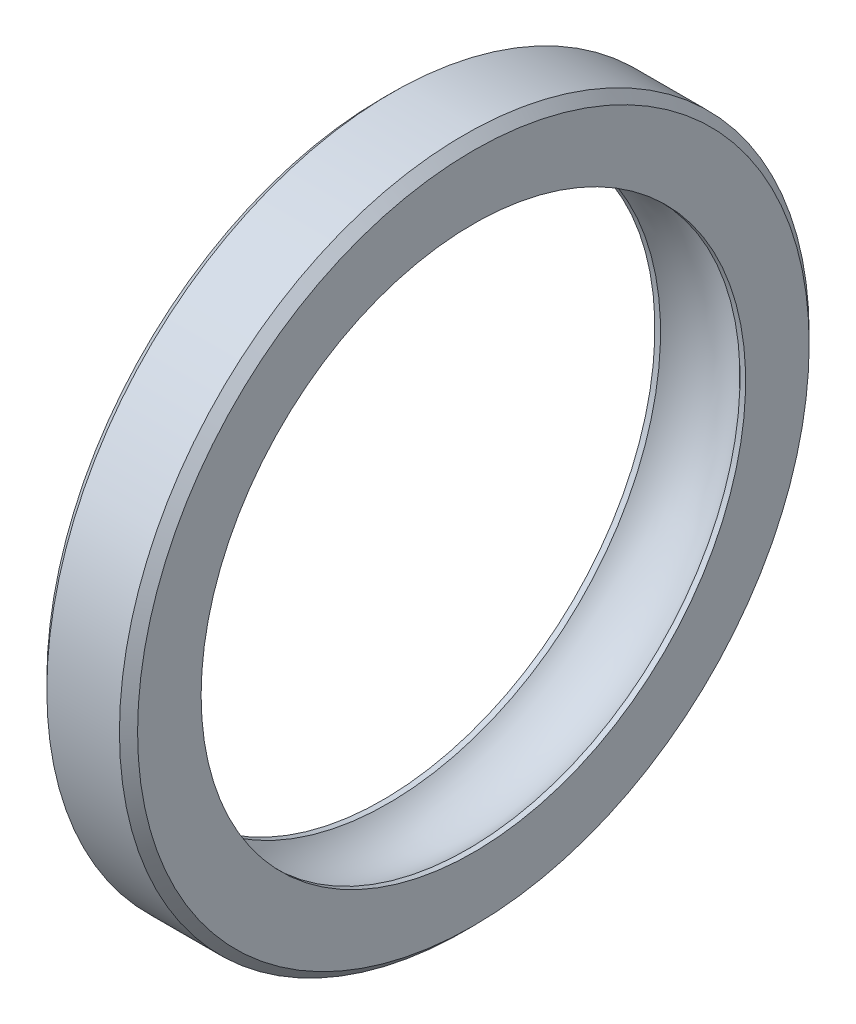
ISO-10303-21;
HEADER;
FILE_DESCRIPTION(('STEP AP214'),'2;1');
FILE_NAME('part.step','',(''),(''),'','','');
FILE_SCHEMA(('AUTOMOTIVE_DESIGN { 1 0 10303 214 1 1 1 1 }'));
ENDSEC;
DATA;
#1=APPLICATION_CONTEXT('core data for automotive mechanical design processes');
#2=APPLICATION_PROTOCOL_DEFINITION('international standard','automotive_design',2000,#1);
#3=PRODUCT_CONTEXT('',#1,'mechanical');
#4=PRODUCT('Part','Part','',(#3));
#5=PRODUCT_RELATED_PRODUCT_CATEGORY('part','',(#4));
#6=PRODUCT_DEFINITION_FORMATION('','',#4);
#7=PRODUCT_DEFINITION_CONTEXT('part definition',#1,'design');
#8=PRODUCT_DEFINITION('design','',#6,#7);
#9=PRODUCT_DEFINITION_SHAPE('','',#8);
#10=(LENGTH_UNIT() NAMED_UNIT(*) SI_UNIT(.MILLI.,.METRE.));
#11=(NAMED_UNIT(*) PLANE_ANGLE_UNIT() SI_UNIT($,.RADIAN.));
#12=(NAMED_UNIT(*) SI_UNIT($,.STERADIAN.) SOLID_ANGLE_UNIT());
#13=UNCERTAINTY_MEASURE_WITH_UNIT(LENGTH_MEASURE(1.E-05),#10,'distance_accuracy_value','');
#14=(GEOMETRIC_REPRESENTATION_CONTEXT(3) GLOBAL_UNCERTAINTY_ASSIGNED_CONTEXT((#13)) GLOBAL_UNIT_ASSIGNED_CONTEXT((#10,
#11,#12)) REPRESENTATION_CONTEXT('',''));
#15=CARTESIAN_POINT('',(0.,0.,0.));
#16=DIRECTION('',(0.,0.,1.));
#17=DIRECTION('',(1.,0.,0.));
#18=AXIS2_PLACEMENT_3D('',#15,#16,#17);
#19=CARTESIAN_POINT('',(-21.3950562234168,0.,0.));
#20=DIRECTION('',(-1.,0.,0.));
#21=DIRECTION('',(0.,0.,1.));
#22=AXIS2_PLACEMENT_3D('',#19,#20,#21);
#23=CYLINDRICAL_SURFACE('',#22,15.);
#24=CARTESIAN_POINT('',(-2.18849366411809,0.,0.));
#25=DIRECTION('',(-1.,0.,0.));
#26=DIRECTION('',(0.,0.,1.));
#27=AXIS2_PLACEMENT_3D('',#24,#25,#26);
#28=CIRCLE('',#27,15.);
#29=CARTESIAN_POINT('',(-2.18849366411809,0.,15.));
#30=VERTEX_POINT('',#29);
#31=EDGE_CURVE('E51',#30,#30,#28,.T.);
#32=ORIENTED_EDGE('',*,*,#31,.F.);
#33=EDGE_LOOP('',(#32));
#34=FACE_BOUND('',#33,.T.);
#35=CARTESIAN_POINT('',(-2.50000000000001,0.,0.));
#36=DIRECTION('',(-1.,0.,0.));
#37=DIRECTION('',(0.,0.,1.));
#38=AXIS2_PLACEMENT_3D('',#35,#36,#37);
#39=CIRCLE('',#38,15.);
#40=CARTESIAN_POINT('',(-2.50000000000001,0.,15.));
#41=VERTEX_POINT('',#40);
#42=EDGE_CURVE('E60',#41,#41,#39,.T.);
#43=ORIENTED_EDGE('',*,*,#42,.T.);
#44=EDGE_LOOP('',(#43));
#45=FACE_BOUND('',#44,.T.);
#46=ADVANCED_FACE('F31',(#34,#45),#23,.F.);
#47=CARTESIAN_POINT('',(0.,0.,0.));
#48=DIRECTION('',(-1.,0.,0.));
#49=DIRECTION('',(0.,0.,1.));
#50=AXIS2_PLACEMENT_3D('',#47,#48,#49);
#51=TOROIDAL_SURFACE('',#50,12.9480508090806,3.);
#52=CARTESIAN_POINT('',(2.18849366411809,0.,0.));
#53=DIRECTION('',(-1.,0.,0.));
#54=DIRECTION('',(0.,0.,1.));
#55=AXIS2_PLACEMENT_3D('',#52,#53,#54);
#56=CIRCLE('',#55,15.);
#57=CARTESIAN_POINT('',(2.18849366411809,0.,15.));
#58=VERTEX_POINT('',#57);
#59=EDGE_CURVE('E54',#58,#58,#56,.T.);
#60=ORIENTED_EDGE('',*,*,#59,.F.);
#61=EDGE_LOOP('',(#60));
#62=FACE_BOUND('',#61,.T.);
#63=ORIENTED_EDGE('',*,*,#31,.T.);
#64=EDGE_LOOP('',(#63));
#65=FACE_BOUND('',#64,.T.);
#66=ADVANCED_FACE('F79',(#62,#65),#51,.F.);
#67=CARTESIAN_POINT('',(-21.3950562234168,0.,0.));
#68=DIRECTION('',(-1.,0.,0.));
#69=DIRECTION('',(0.,0.,1.));
#70=AXIS2_PLACEMENT_3D('',#67,#68,#69);
#71=CYLINDRICAL_SURFACE('',#70,15.);
#72=CARTESIAN_POINT('',(2.5,0.,0.));
#73=DIRECTION('',(-1.,0.,0.));
#74=DIRECTION('',(0.,0.,1.));
#75=AXIS2_PLACEMENT_3D('',#72,#73,#74);
#76=CIRCLE('',#75,15.);
#77=CARTESIAN_POINT('',(2.5,0.,15.));
#78=VERTEX_POINT('',#77);
#79=EDGE_CURVE('E57',#78,#78,#76,.T.);
#80=ORIENTED_EDGE('',*,*,#79,.F.);
#81=EDGE_LOOP('',(#80));
#82=FACE_BOUND('',#81,.T.);
#83=ORIENTED_EDGE('',*,*,#59,.T.);
#84=EDGE_LOOP('',(#83));
#85=FACE_BOUND('',#84,.T.);
#86=ADVANCED_FACE('F85',(#82,#85),#71,.F.);
#87=CARTESIAN_POINT('',(2.49999999999999,0.,0.));
#88=DIRECTION('',(1.,0.,0.));
#89=DIRECTION('',(0.,0.,-1.));
#90=AXIS2_PLACEMENT_3D('',#87,#88,#89);
#91=PLANE('',#90);
#92=CARTESIAN_POINT('',(2.49999999999999,0.,0.));
#93=DIRECTION('',(1.,0.,0.));
#94=DIRECTION('',(0.,0.,-1.));
#95=AXIS2_PLACEMENT_3D('',#92,#93,#94);
#96=CIRCLE('',#95,18.5);
#97=CARTESIAN_POINT('',(2.49999999999999,0.,-18.5));
#98=VERTEX_POINT('',#97);
#99=EDGE_CURVE('E10',#98,#98,#96,.T.);
#100=ORIENTED_EDGE('',*,*,#99,.T.);
#101=EDGE_LOOP('',(#100));
#102=FACE_BOUND('',#101,.T.);
#103=ORIENTED_EDGE('',*,*,#79,.T.);
#104=EDGE_LOOP('',(#103));
#105=FACE_BOUND('',#104,.T.);
#106=ADVANCED_FACE('F76',(#102,#105),#91,.T.);
#107=CARTESIAN_POINT('',(-21.3950562234168,0.,0.));
#108=DIRECTION('',(-1.,0.,0.));
#109=DIRECTION('',(0.,0.,1.));
#110=AXIS2_PLACEMENT_3D('',#107,#108,#109);
#111=CYLINDRICAL_SURFACE('',#110,19.);
#112=CARTESIAN_POINT('',(-1.99999999999998,0.,0.));
#113=DIRECTION('',(1.,0.,0.));
#114=DIRECTION('',(0.,0.,-1.));
#115=AXIS2_PLACEMENT_3D('',#112,#113,#114);
#116=CIRCLE('',#115,19.);
#117=CARTESIAN_POINT('',(-1.99999999999998,0.,-19.));
#118=VERTEX_POINT('',#117);
#119=EDGE_CURVE('E38',#118,#118,#116,.T.);
#120=ORIENTED_EDGE('',*,*,#119,.T.);
#121=EDGE_LOOP('',(#120));
#122=FACE_BOUND('',#121,.T.);
#123=CARTESIAN_POINT('',(1.99999999999999,0.,0.));
#124=DIRECTION('',(1.,0.,0.));
#125=DIRECTION('',(0.,0.,-1.));
#126=AXIS2_PLACEMENT_3D('',#123,#124,#125);
#127=CIRCLE('',#126,19.);
#128=CARTESIAN_POINT('',(1.99999999999999,0.,-19.));
#129=VERTEX_POINT('',#128);
#130=EDGE_CURVE('E42',#129,#129,#127,.F.);
#131=ORIENTED_EDGE('',*,*,#130,.T.);
#132=EDGE_LOOP('',(#131));
#133=FACE_BOUND('',#132,.T.);
#134=ADVANCED_FACE('F68',(#122,#133),#111,.T.);
#135=CARTESIAN_POINT('',(-2.50000000000001,0.,0.));
#136=DIRECTION('',(1.,0.,0.));
#137=DIRECTION('',(0.,0.,-1.));
#138=AXIS2_PLACEMENT_3D('',#135,#136,#137);
#139=PLANE('',#138);
#140=CARTESIAN_POINT('',(-2.50000000000001,0.,0.));
#141=DIRECTION('',(1.,0.,0.));
#142=DIRECTION('',(0.,0.,-1.));
#143=AXIS2_PLACEMENT_3D('',#140,#141,#142);
#144=CIRCLE('',#143,18.5);
#145=CARTESIAN_POINT('',(-2.50000000000001,0.,-18.5));
#146=VERTEX_POINT('',#145);
#147=EDGE_CURVE('E46',#146,#146,#144,.F.);
#148=ORIENTED_EDGE('',*,*,#147,.T.);
#149=EDGE_LOOP('',(#148));
#150=FACE_BOUND('',#149,.T.);
#151=ORIENTED_EDGE('',*,*,#42,.F.);
#152=EDGE_LOOP('',(#151));
#153=FACE_BOUND('',#152,.T.);
#154=ADVANCED_FACE('F65',(#150,#153),#139,.F.);
#155=CARTESIAN_POINT('',(-2.50000000000001,0.,0.));
#156=DIRECTION('',(1.,0.,0.));
#157=DIRECTION('',(0.,0.,-1.));
#158=AXIS2_PLACEMENT_3D('',#155,#156,#157);
#159=CONICAL_SURFACE('',#158,18.5,0.785398163397438);
#160=ORIENTED_EDGE('',*,*,#119,.F.);
#161=EDGE_LOOP('',(#160));
#162=FACE_BOUND('',#161,.T.);
#163=ORIENTED_EDGE('',*,*,#147,.F.);
#164=EDGE_LOOP('',(#163));
#165=FACE_BOUND('',#164,.T.);
#166=ADVANCED_FACE('F67',(#162,#165),#159,.T.);
#167=CARTESIAN_POINT('',(1.99999999999999,0.,0.));
#168=DIRECTION('',(-1.,0.,0.));
#169=DIRECTION('',(0.,0.,1.));
#170=AXIS2_PLACEMENT_3D('',#167,#168,#169);
#171=CONICAL_SURFACE('',#170,19.,0.785398163397448);
#172=ORIENTED_EDGE('',*,*,#99,.F.);
#173=EDGE_LOOP('',(#172));
#174=FACE_BOUND('',#173,.T.);
#175=ORIENTED_EDGE('',*,*,#130,.F.);
#176=EDGE_LOOP('',(#175));
#177=FACE_BOUND('',#176,.T.);
#178=ADVANCED_FACE('F33',(#174,#177),#171,.T.);
#179=CLOSED_SHELL('',(#46,#66,#86,#106,#134,#154,#166,#178));
#180=MANIFOLD_SOLID_BREP('B2',#179);
#181=ADVANCED_BREP_SHAPE_REPRESENTATION('',(#18,#180),#14);
#182=SHAPE_DEFINITION_REPRESENTATION(#9,#181);
ENDSEC;
END-ISO-10303-21;
